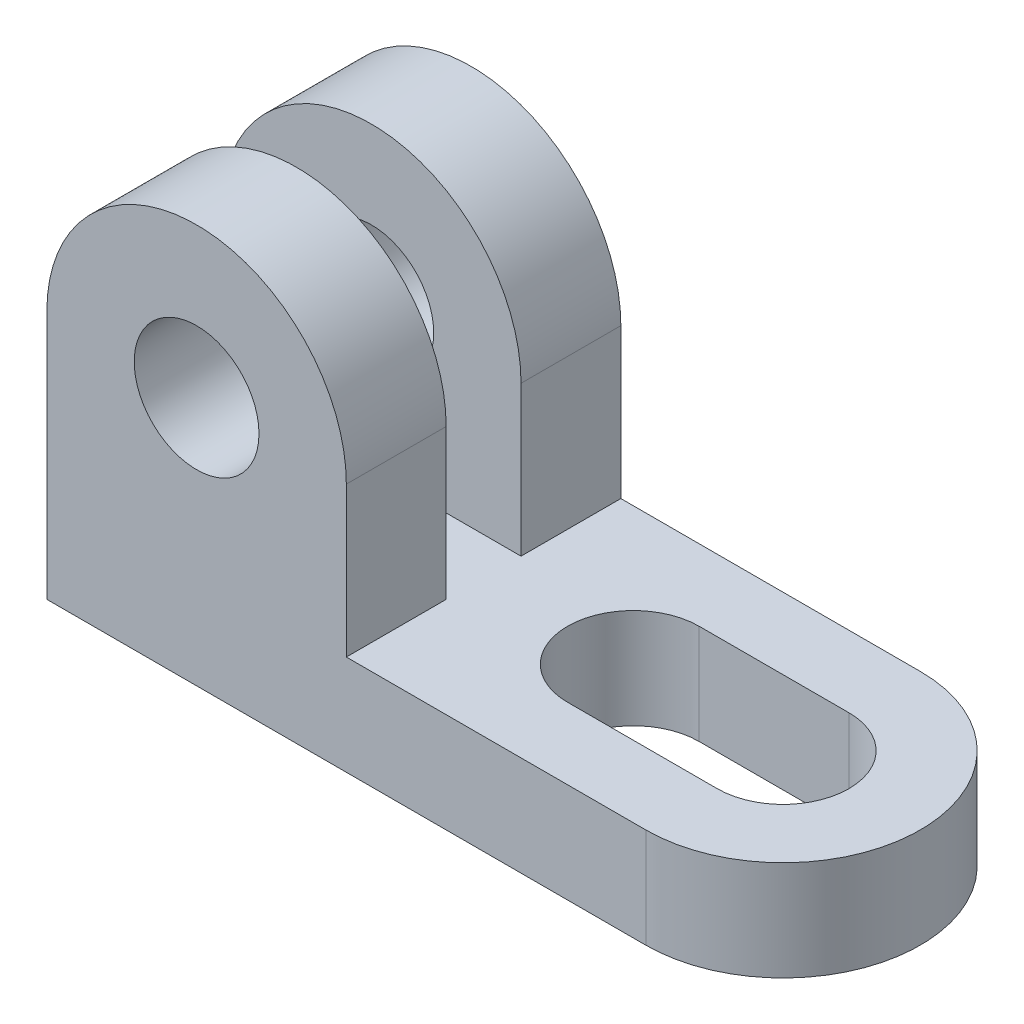
ISO-10303-21;
HEADER;
FILE_DESCRIPTION(('STEP AP214'),'2;1');
FILE_NAME('part.step','',(''),(''),'','','');
FILE_SCHEMA(('AUTOMOTIVE_DESIGN { 1 0 10303 214 1 1 1 1 }'));
ENDSEC;
DATA;
#1=APPLICATION_CONTEXT('core data for automotive mechanical design processes');
#2=APPLICATION_PROTOCOL_DEFINITION('international standard','automotive_design',2000,#1);
#3=PRODUCT_CONTEXT('',#1,'mechanical');
#4=PRODUCT('Part','Part','',(#3));
#5=PRODUCT_RELATED_PRODUCT_CATEGORY('part','',(#4));
#6=PRODUCT_DEFINITION_FORMATION('','',#4);
#7=PRODUCT_DEFINITION_CONTEXT('part definition',#1,'design');
#8=PRODUCT_DEFINITION('design','',#6,#7);
#9=PRODUCT_DEFINITION_SHAPE('','',#8);
#10=(LENGTH_UNIT() NAMED_UNIT(*) SI_UNIT(.MILLI.,.METRE.));
#11=(NAMED_UNIT(*) PLANE_ANGLE_UNIT() SI_UNIT($,.RADIAN.));
#12=(NAMED_UNIT(*) SI_UNIT($,.STERADIAN.) SOLID_ANGLE_UNIT());
#13=UNCERTAINTY_MEASURE_WITH_UNIT(LENGTH_MEASURE(1.E-05),#10,'distance_accuracy_value','');
#14=(GEOMETRIC_REPRESENTATION_CONTEXT(3) GLOBAL_UNCERTAINTY_ASSIGNED_CONTEXT((#13)) GLOBAL_UNIT_ASSIGNED_CONTEXT((#10,
#11,#12)) REPRESENTATION_CONTEXT('',''));
#15=CARTESIAN_POINT('',(0.,0.,0.));
#16=DIRECTION('',(0.,0.,1.));
#17=DIRECTION('',(1.,0.,0.));
#18=AXIS2_PLACEMENT_3D('',#15,#16,#17);
#19=CARTESIAN_POINT('',(0.,16.,0.));
#20=DIRECTION('',(0.,1.,0.));
#21=DIRECTION('',(0.,0.,1.));
#22=AXIS2_PLACEMENT_3D('',#19,#20,#21);
#23=PLANE('',#22);
#24=DIRECTION('',(-1.,0.,0.));
#25=VECTOR('',#24,1.);
#26=CARTESIAN_POINT('',(0.,16.,-10.548244424278));
#27=LINE('',#26,#25);
#28=CARTESIAN_POINT('',(37.,16.,-10.548244424278));
#29=VERTEX_POINT('',#28);
#30=CARTESIAN_POINT('',(13.,16.,-10.548244424278));
#31=VERTEX_POINT('',#30);
#32=EDGE_CURVE('E262',#29,#31,#27,.T.);
#33=ORIENTED_EDGE('',*,*,#32,.F.);
#34=CARTESIAN_POINT('',(37.,16.,0.));
#35=DIRECTION('',(0.,1.,0.));
#36=DIRECTION('',(0.,0.,1.));
#37=AXIS2_PLACEMENT_3D('',#34,#35,#36);
#38=CIRCLE('',#37,10.548244424278);
#39=CARTESIAN_POINT('',(37.,16.,10.548244424278));
#40=VERTEX_POINT('',#39);
#41=EDGE_CURVE('E266',#40,#29,#38,.T.);
#42=ORIENTED_EDGE('',*,*,#41,.F.);
#43=DIRECTION('',(-1.,0.,0.));
#44=VECTOR('',#43,1.);
#45=CARTESIAN_POINT('',(0.,16.,10.548244424278));
#46=LINE('',#45,#44);
#47=CARTESIAN_POINT('',(13.,16.,10.548244424278));
#48=VERTEX_POINT('',#47);
#49=EDGE_CURVE('E271',#40,#48,#46,.T.);
#50=ORIENTED_EDGE('',*,*,#49,.T.);
#51=CARTESIAN_POINT('',(13.,16.,0.));
#52=DIRECTION('',(0.,1.,0.));
#53=DIRECTION('',(0.,0.,1.));
#54=AXIS2_PLACEMENT_3D('',#51,#52,#53);
#55=CIRCLE('',#54,10.548244424278);
#56=EDGE_CURVE('E274',#31,#48,#55,.T.);
#57=ORIENTED_EDGE('',*,*,#56,.F.);
#58=EDGE_LOOP('',(#33,#42,#50,#57));
#59=FACE_BOUND('',#58,.T.);
#60=DIRECTION('',(1.,0.,0.));
#61=VECTOR('',#60,1.);
#62=CARTESIAN_POINT('',(0.,16.,-22.));
#63=LINE('',#62,#61);
#64=CARTESIAN_POINT('',(-11.,16.,-22.));
#65=VERTEX_POINT('',#64);
#66=CARTESIAN_POINT('',(37.,16.,-22.));
#67=VERTEX_POINT('',#66);
#68=EDGE_CURVE('E282',#65,#67,#63,.T.);
#69=ORIENTED_EDGE('',*,*,#68,.F.);
#70=DIRECTION('',(0.,0.,-1.));
#71=VECTOR('',#70,1.);
#72=CARTESIAN_POINT('',(-11.,16.,-6.));
#73=LINE('',#72,#71);
#74=CARTESIAN_POINT('',(-11.,16.,-6.));
#75=VERTEX_POINT('',#74);
#76=EDGE_CURVE('E213',#75,#65,#73,.T.);
#77=ORIENTED_EDGE('',*,*,#76,.F.);
#78=DIRECTION('',(-1.,0.,0.));
#79=VECTOR('',#78,1.);
#80=CARTESIAN_POINT('',(0.,16.,-6.));
#81=LINE('',#80,#79);
#82=CARTESIAN_POINT('',(-59.,16.,-6.));
#83=VERTEX_POINT('',#82);
#84=EDGE_CURVE('E205',#75,#83,#81,.T.);
#85=ORIENTED_EDGE('',*,*,#84,.T.);
#86=DIRECTION('',(0.,0.,1.));
#87=VECTOR('',#86,1.);
#88=CARTESIAN_POINT('',(-59.,16.,0.));
#89=LINE('',#88,#87);
#90=CARTESIAN_POINT('',(-59.,16.,6.));
#91=VERTEX_POINT('',#90);
#92=EDGE_CURVE('E285',#83,#91,#89,.T.);
#93=ORIENTED_EDGE('',*,*,#92,.T.);
#94=DIRECTION('',(-1.,0.,0.));
#95=VECTOR('',#94,1.);
#96=CARTESIAN_POINT('',(0.,16.,6.));
#97=LINE('',#96,#95);
#98=CARTESIAN_POINT('',(-11.,16.,6.));
#99=VERTEX_POINT('',#98);
#100=EDGE_CURVE('E230',#99,#91,#97,.T.);
#101=ORIENTED_EDGE('',*,*,#100,.F.);
#102=DIRECTION('',(0.,0.,1.));
#103=VECTOR('',#102,1.);
#104=CARTESIAN_POINT('',(-11.,16.,6.));
#105=LINE('',#104,#103);
#106=CARTESIAN_POINT('',(-11.,16.,22.));
#107=VERTEX_POINT('',#106);
#108=EDGE_CURVE('E242',#99,#107,#105,.T.);
#109=ORIENTED_EDGE('',*,*,#108,.T.);
#110=DIRECTION('',(1.,0.,0.));
#111=VECTOR('',#110,1.);
#112=CARTESIAN_POINT('',(0.,16.,22.));
#113=LINE('',#112,#111);
#114=CARTESIAN_POINT('',(37.,16.,22.));
#115=VERTEX_POINT('',#114);
#116=EDGE_CURVE('E288',#107,#115,#113,.T.);
#117=ORIENTED_EDGE('',*,*,#116,.T.);
#118=CARTESIAN_POINT('',(37.,16.,0.));
#119=DIRECTION('',(0.,1.,0.));
#120=DIRECTION('',(0.,0.,1.));
#121=AXIS2_PLACEMENT_3D('',#118,#119,#120);
#122=CIRCLE('',#121,22.);
#123=EDGE_CURVE('E278',#115,#67,#122,.T.);
#124=ORIENTED_EDGE('',*,*,#123,.T.);
#125=EDGE_LOOP('',(#69,#77,#85,#93,#101,#109,#117,#124));
#126=FACE_BOUND('',#125,.T.);
#127=ADVANCED_FACE('F85',(#59,#126),#23,.T.);
#128=CARTESIAN_POINT('',(37.,16.,0.));
#129=DIRECTION('',(0.,-1.,0.));
#130=DIRECTION('',(0.,0.,-1.));
#131=AXIS2_PLACEMENT_3D('',#128,#129,#130);
#132=CYLINDRICAL_SURFACE('',#131,22.);
#133=CARTESIAN_POINT('',(37.,0.,0.));
#134=DIRECTION('',(0.,1.,0.));
#135=DIRECTION('',(0.,0.,1.));
#136=AXIS2_PLACEMENT_3D('',#133,#134,#135);
#137=CIRCLE('',#136,22.);
#138=CARTESIAN_POINT('',(37.,0.,22.));
#139=VERTEX_POINT('',#138);
#140=CARTESIAN_POINT('',(37.,0.,-22.));
#141=VERTEX_POINT('',#140);
#142=EDGE_CURVE('E307',#139,#141,#137,.T.);
#143=ORIENTED_EDGE('',*,*,#142,.T.);
#144=DIRECTION('',(0.,-1.,0.));
#145=VECTOR('',#144,1.);
#146=CARTESIAN_POINT('',(37.,16.,-22.));
#147=LINE('',#146,#145);
#148=EDGE_CURVE('E12',#67,#141,#147,.T.);
#149=ORIENTED_EDGE('',*,*,#148,.F.);
#150=ORIENTED_EDGE('',*,*,#123,.F.);
#151=DIRECTION('',(0.,-1.,0.));
#152=VECTOR('',#151,1.);
#153=CARTESIAN_POINT('',(37.,16.,22.));
#154=LINE('',#153,#152);
#155=EDGE_CURVE('E321',#115,#139,#154,.T.);
#156=ORIENTED_EDGE('',*,*,#155,.T.);
#157=EDGE_LOOP('',(#143,#149,#150,#156));
#158=FACE_BOUND('',#157,.T.);
#159=ADVANCED_FACE('F359',(#158),#132,.T.);
#160=CARTESIAN_POINT('',(0.,16.,-22.));
#161=DIRECTION('',(0.,0.,-1.));
#162=DIRECTION('',(-1.,0.,0.));
#163=AXIS2_PLACEMENT_3D('',#160,#161,#162);
#164=PLANE('',#163);
#165=CARTESIAN_POINT('',(-35.,40.,-22.));
#166=DIRECTION('',(0.,0.,1.));
#167=DIRECTION('',(1.,0.,0.));
#168=AXIS2_PLACEMENT_3D('',#165,#166,#167);
#169=CIRCLE('',#168,10.);
#170=CARTESIAN_POINT('',(-25.,40.,-22.));
#171=VERTEX_POINT('',#170);
#172=EDGE_CURVE('E379',#171,#171,#169,.T.);
#173=ORIENTED_EDGE('',*,*,#172,.T.);
#174=EDGE_LOOP('',(#173));
#175=FACE_BOUND('',#174,.T.);
#176=DIRECTION('',(1.,0.,0.));
#177=VECTOR('',#176,1.);
#178=CARTESIAN_POINT('',(0.,0.,-22.));
#179=LINE('',#178,#177);
#180=CARTESIAN_POINT('',(-59.,0.,-22.));
#181=VERTEX_POINT('',#180);
#182=EDGE_CURVE('E311',#181,#141,#179,.T.);
#183=ORIENTED_EDGE('',*,*,#182,.F.);
#184=DIRECTION('',(0.,-1.,0.));
#185=VECTOR('',#184,1.);
#186=CARTESIAN_POINT('',(-59.,16.,-22.));
#187=LINE('',#186,#185);
#188=CARTESIAN_POINT('',(-59.,40.,-22.));
#189=VERTEX_POINT('',#188);
#190=EDGE_CURVE('E95',#189,#181,#187,.T.);
#191=ORIENTED_EDGE('',*,*,#190,.F.);
#192=CARTESIAN_POINT('',(-35.,40.,-22.));
#193=DIRECTION('',(0.,0.,1.));
#194=DIRECTION('',(1.,0.,0.));
#195=AXIS2_PLACEMENT_3D('',#192,#193,#194);
#196=CIRCLE('',#195,24.);
#197=CARTESIAN_POINT('',(-11.,40.,-22.));
#198=VERTEX_POINT('',#197);
#199=EDGE_CURVE('E199',#198,#189,#196,.T.);
#200=ORIENTED_EDGE('',*,*,#199,.F.);
#201=DIRECTION('',(0.,1.,0.));
#202=VECTOR('',#201,1.);
#203=CARTESIAN_POINT('',(-11.,0.,-22.));
#204=LINE('',#203,#202);
#205=EDGE_CURVE('E103',#65,#198,#204,.T.);
#206=ORIENTED_EDGE('',*,*,#205,.F.);
#207=ORIENTED_EDGE('',*,*,#68,.T.);
#208=ORIENTED_EDGE('',*,*,#148,.T.);
#209=EDGE_LOOP('',(#183,#191,#200,#206,#207,#208));
#210=FACE_BOUND('',#209,.T.);
#211=ADVANCED_FACE('F365',(#175,#210),#164,.T.);
#212=CARTESIAN_POINT('',(-59.,16.,0.));
#213=DIRECTION('',(1.,0.,0.));
#214=DIRECTION('',(0.,0.,-1.));
#215=AXIS2_PLACEMENT_3D('',#212,#213,#214);
#216=PLANE('',#215);
#217=DIRECTION('',(0.,1.,0.));
#218=VECTOR('',#217,1.);
#219=CARTESIAN_POINT('',(-59.,0.,6.));
#220=LINE('',#219,#218);
#221=CARTESIAN_POINT('',(-59.,40.,6.));
#222=VERTEX_POINT('',#221);
#223=EDGE_CURVE('E238',#91,#222,#220,.T.);
#224=ORIENTED_EDGE('',*,*,#223,.F.);
#225=ORIENTED_EDGE('',*,*,#92,.F.);
#226=DIRECTION('',(0.,1.,0.));
#227=VECTOR('',#226,1.);
#228=CARTESIAN_POINT('',(-59.,0.,-6.));
#229=LINE('',#228,#227);
#230=CARTESIAN_POINT('',(-59.,40.,-6.));
#231=VERTEX_POINT('',#230);
#232=EDGE_CURVE('E209',#83,#231,#229,.T.);
#233=ORIENTED_EDGE('',*,*,#232,.T.);
#234=DIRECTION('',(0.,0.,-1.));
#235=VECTOR('',#234,1.);
#236=CARTESIAN_POINT('',(-59.,40.,-6.));
#237=LINE('',#236,#235);
#238=EDGE_CURVE('E195',#231,#189,#237,.T.);
#239=ORIENTED_EDGE('',*,*,#238,.T.);
#240=ORIENTED_EDGE('',*,*,#190,.T.);
#241=DIRECTION('',(0.,0.,1.));
#242=VECTOR('',#241,1.);
#243=CARTESIAN_POINT('',(-59.,0.,0.));
#244=LINE('',#243,#242);
#245=CARTESIAN_POINT('',(-59.,0.,22.));
#246=VERTEX_POINT('',#245);
#247=EDGE_CURVE('E315',#181,#246,#244,.T.);
#248=ORIENTED_EDGE('',*,*,#247,.T.);
#249=DIRECTION('',(0.,-1.,0.));
#250=VECTOR('',#249,1.);
#251=CARTESIAN_POINT('',(-59.,16.,22.));
#252=LINE('',#251,#250);
#253=CARTESIAN_POINT('',(-59.,40.,22.));
#254=VERTEX_POINT('',#253);
#255=EDGE_CURVE('E325',#254,#246,#252,.T.);
#256=ORIENTED_EDGE('',*,*,#255,.F.);
#257=DIRECTION('',(0.,0.,1.));
#258=VECTOR('',#257,1.);
#259=CARTESIAN_POINT('',(-59.,40.,6.));
#260=LINE('',#259,#258);
#261=EDGE_CURVE('E246',#222,#254,#260,.T.);
#262=ORIENTED_EDGE('',*,*,#261,.F.);
#263=EDGE_LOOP('',(#224,#225,#233,#239,#240,#248,#256,#262));
#264=FACE_BOUND('',#263,.T.);
#265=ADVANCED_FACE('F373',(#264),#216,.F.);
#266=CARTESIAN_POINT('',(0.,16.,-10.548244424278));
#267=DIRECTION('',(0.,0.,1.));
#268=DIRECTION('',(1.,0.,0.));
#269=AXIS2_PLACEMENT_3D('',#266,#267,#268);
#270=PLANE('',#269);
#271=DIRECTION('',(-1.,0.,0.));
#272=VECTOR('',#271,1.);
#273=CARTESIAN_POINT('',(0.,0.,-10.548244424278));
#274=LINE('',#273,#272);
#275=CARTESIAN_POINT('',(37.,0.,-10.548244424278));
#276=VERTEX_POINT('',#275);
#277=CARTESIAN_POINT('',(13.,0.,-10.548244424278));
#278=VERTEX_POINT('',#277);
#279=EDGE_CURVE('E250',#276,#278,#274,.T.);
#280=ORIENTED_EDGE('',*,*,#279,.F.);
#281=DIRECTION('',(0.,-1.,0.));
#282=VECTOR('',#281,1.);
#283=CARTESIAN_POINT('',(37.,16.,-10.548244424278));
#284=LINE('',#283,#282);
#285=EDGE_CURVE('E89',#29,#276,#284,.T.);
#286=ORIENTED_EDGE('',*,*,#285,.F.);
#287=ORIENTED_EDGE('',*,*,#32,.T.);
#288=DIRECTION('',(0.,-1.,0.));
#289=VECTOR('',#288,1.);
#290=CARTESIAN_POINT('',(13.,16.,-10.548244424278));
#291=LINE('',#290,#289);
#292=EDGE_CURVE('E291',#31,#278,#291,.T.);
#293=ORIENTED_EDGE('',*,*,#292,.T.);
#294=EDGE_LOOP('',(#280,#286,#287,#293));
#295=FACE_BOUND('',#294,.T.);
#296=ADVANCED_FACE('F87',(#295),#270,.T.);
#297=CARTESIAN_POINT('',(37.,16.,0.));
#298=DIRECTION('',(0.,-1.,0.));
#299=DIRECTION('',(0.,0.,-1.));
#300=AXIS2_PLACEMENT_3D('',#297,#298,#299);
#301=CYLINDRICAL_SURFACE('',#300,10.548244424278);
#302=CARTESIAN_POINT('',(37.,0.,0.));
#303=DIRECTION('',(0.,1.,0.));
#304=DIRECTION('',(0.,0.,1.));
#305=AXIS2_PLACEMENT_3D('',#302,#303,#304);
#306=CIRCLE('',#305,10.548244424278);
#307=CARTESIAN_POINT('',(37.,0.,10.548244424278));
#308=VERTEX_POINT('',#307);
#309=EDGE_CURVE('E295',#308,#276,#306,.T.);
#310=ORIENTED_EDGE('',*,*,#309,.F.);
#311=DIRECTION('',(0.,-1.,0.));
#312=VECTOR('',#311,1.);
#313=CARTESIAN_POINT('',(37.,16.,10.548244424278));
#314=LINE('',#313,#312);
#315=EDGE_CURVE('E334',#40,#308,#314,.T.);
#316=ORIENTED_EDGE('',*,*,#315,.F.);
#317=ORIENTED_EDGE('',*,*,#41,.T.);
#318=ORIENTED_EDGE('',*,*,#285,.T.);
#319=EDGE_LOOP('',(#310,#316,#317,#318));
#320=FACE_BOUND('',#319,.T.);
#321=ADVANCED_FACE('F343',(#320),#301,.F.);
#322=CARTESIAN_POINT('',(0.,16.,10.548244424278));
#323=DIRECTION('',(0.,0.,1.));
#324=DIRECTION('',(1.,0.,0.));
#325=AXIS2_PLACEMENT_3D('',#322,#323,#324);
#326=PLANE('',#325);
#327=DIRECTION('',(-1.,0.,0.));
#328=VECTOR('',#327,1.);
#329=CARTESIAN_POINT('',(0.,0.,10.548244424278));
#330=LINE('',#329,#328);
#331=CARTESIAN_POINT('',(13.,0.,10.548244424278));
#332=VERTEX_POINT('',#331);
#333=EDGE_CURVE('E299',#308,#332,#330,.T.);
#334=ORIENTED_EDGE('',*,*,#333,.T.);
#335=DIRECTION('',(0.,-1.,0.));
#336=VECTOR('',#335,1.);
#337=CARTESIAN_POINT('',(13.,16.,10.548244424278));
#338=LINE('',#337,#336);
#339=EDGE_CURVE('E332',#48,#332,#338,.T.);
#340=ORIENTED_EDGE('',*,*,#339,.F.);
#341=ORIENTED_EDGE('',*,*,#49,.F.);
#342=ORIENTED_EDGE('',*,*,#315,.T.);
#343=EDGE_LOOP('',(#334,#340,#341,#342));
#344=FACE_BOUND('',#343,.T.);
#345=ADVANCED_FACE('F352',(#344),#326,.F.);
#346=CARTESIAN_POINT('',(13.,16.,0.));
#347=DIRECTION('',(0.,-1.,0.));
#348=DIRECTION('',(0.,0.,-1.));
#349=AXIS2_PLACEMENT_3D('',#346,#347,#348);
#350=CYLINDRICAL_SURFACE('',#349,10.548244424278);
#351=CARTESIAN_POINT('',(13.,0.,0.));
#352=DIRECTION('',(0.,1.,0.));
#353=DIRECTION('',(0.,0.,1.));
#354=AXIS2_PLACEMENT_3D('',#351,#352,#353);
#355=CIRCLE('',#354,10.548244424278);
#356=EDGE_CURVE('E303',#278,#332,#355,.T.);
#357=ORIENTED_EDGE('',*,*,#356,.F.);
#358=ORIENTED_EDGE('',*,*,#292,.F.);
#359=ORIENTED_EDGE('',*,*,#56,.T.);
#360=ORIENTED_EDGE('',*,*,#339,.T.);
#361=EDGE_LOOP('',(#357,#358,#359,#360));
#362=FACE_BOUND('',#361,.T.);
#363=ADVANCED_FACE('F355',(#362),#350,.F.);
#364=CARTESIAN_POINT('',(0.,16.,22.));
#365=DIRECTION('',(0.,0.,-1.));
#366=DIRECTION('',(-1.,0.,0.));
#367=AXIS2_PLACEMENT_3D('',#364,#365,#366);
#368=PLANE('',#367);
#369=CARTESIAN_POINT('',(-35.,40.,22.));
#370=DIRECTION('',(0.,0.,1.));
#371=DIRECTION('',(1.,0.,0.));
#372=AXIS2_PLACEMENT_3D('',#369,#370,#371);
#373=CIRCLE('',#372,10.);
#374=CARTESIAN_POINT('',(-25.,40.,22.));
#375=VERTEX_POINT('',#374);
#376=EDGE_CURVE('E217',#375,#375,#373,.T.);
#377=ORIENTED_EDGE('',*,*,#376,.F.);
#378=EDGE_LOOP('',(#377));
#379=FACE_BOUND('',#378,.T.);
#380=ORIENTED_EDGE('',*,*,#255,.T.);
#381=DIRECTION('',(1.,0.,0.));
#382=VECTOR('',#381,1.);
#383=CARTESIAN_POINT('',(0.,0.,22.));
#384=LINE('',#383,#382);
#385=EDGE_CURVE('E267',#246,#139,#384,.T.);
#386=ORIENTED_EDGE('',*,*,#385,.T.);
#387=ORIENTED_EDGE('',*,*,#155,.F.);
#388=ORIENTED_EDGE('',*,*,#116,.F.);
#389=DIRECTION('',(0.,1.,0.));
#390=VECTOR('',#389,1.);
#391=CARTESIAN_POINT('',(-11.,0.,22.));
#392=LINE('',#391,#390);
#393=CARTESIAN_POINT('',(-11.,40.,22.));
#394=VERTEX_POINT('',#393);
#395=EDGE_CURVE('E111',#107,#394,#392,.T.);
#396=ORIENTED_EDGE('',*,*,#395,.T.);
#397=CARTESIAN_POINT('',(-35.,40.,22.));
#398=DIRECTION('',(0.,0.,1.));
#399=DIRECTION('',(1.,0.,0.));
#400=AXIS2_PLACEMENT_3D('',#397,#398,#399);
#401=CIRCLE('',#400,24.);
#402=EDGE_CURVE('E226',#394,#254,#401,.T.);
#403=ORIENTED_EDGE('',*,*,#402,.T.);
#404=EDGE_LOOP('',(#380,#386,#387,#388,#396,#403));
#405=FACE_BOUND('',#404,.T.);
#406=ADVANCED_FACE('F399',(#379,#405),#368,.F.);
#407=CARTESIAN_POINT('',(0.,0.,0.));
#408=DIRECTION('',(0.,1.,0.));
#409=DIRECTION('',(0.,0.,1.));
#410=AXIS2_PLACEMENT_3D('',#407,#408,#409);
#411=PLANE('',#410);
#412=ORIENTED_EDGE('',*,*,#279,.T.);
#413=ORIENTED_EDGE('',*,*,#356,.T.);
#414=ORIENTED_EDGE('',*,*,#333,.F.);
#415=ORIENTED_EDGE('',*,*,#309,.T.);
#416=EDGE_LOOP('',(#412,#413,#414,#415));
#417=FACE_BOUND('',#416,.T.);
#418=ORIENTED_EDGE('',*,*,#142,.F.);
#419=ORIENTED_EDGE('',*,*,#385,.F.);
#420=ORIENTED_EDGE('',*,*,#247,.F.);
#421=ORIENTED_EDGE('',*,*,#182,.T.);
#422=EDGE_LOOP('',(#418,#419,#420,#421));
#423=FACE_BOUND('',#422,.T.);
#424=ADVANCED_FACE('F349',(#417,#423),#411,.F.);
#425=CARTESIAN_POINT('',(-11.,0.,6.));
#426=DIRECTION('',(1.,0.,0.));
#427=DIRECTION('',(0.,1.,0.));
#428=AXIS2_PLACEMENT_3D('',#425,#426,#427);
#429=PLANE('',#428);
#430=ORIENTED_EDGE('',*,*,#395,.F.);
#431=ORIENTED_EDGE('',*,*,#108,.F.);
#432=DIRECTION('',(0.,1.,0.));
#433=VECTOR('',#432,1.);
#434=CARTESIAN_POINT('',(-11.,0.,6.));
#435=LINE('',#434,#433);
#436=CARTESIAN_POINT('',(-11.,40.,6.));
#437=VERTEX_POINT('',#436);
#438=EDGE_CURVE('E234',#99,#437,#435,.T.);
#439=ORIENTED_EDGE('',*,*,#438,.T.);
#440=DIRECTION('',(0.,0.,1.));
#441=VECTOR('',#440,1.);
#442=CARTESIAN_POINT('',(-11.,40.,6.));
#443=LINE('',#442,#441);
#444=EDGE_CURVE('E251',#437,#394,#443,.T.);
#445=ORIENTED_EDGE('',*,*,#444,.T.);
#446=EDGE_LOOP('',(#430,#431,#439,#445));
#447=FACE_BOUND('',#446,.T.);
#448=ADVANCED_FACE('F396',(#447),#429,.T.);
#449=CARTESIAN_POINT('',(0.,0.,6.));
#450=DIRECTION('',(0.,0.,1.));
#451=DIRECTION('',(1.,0.,0.));
#452=AXIS2_PLACEMENT_3D('',#449,#450,#451);
#453=PLANE('',#452);
#454=CARTESIAN_POINT('',(-35.,40.,6.));
#455=DIRECTION('',(0.,0.,1.));
#456=DIRECTION('',(1.,0.,0.));
#457=AXIS2_PLACEMENT_3D('',#454,#455,#456);
#458=CIRCLE('',#457,10.);
#459=CARTESIAN_POINT('',(-25.,40.,6.));
#460=VERTEX_POINT('',#459);
#461=EDGE_CURVE('E222',#460,#460,#458,.T.);
#462=ORIENTED_EDGE('',*,*,#461,.T.);
#463=EDGE_LOOP('',(#462));
#464=FACE_BOUND('',#463,.T.);
#465=CARTESIAN_POINT('',(-35.,40.,6.));
#466=DIRECTION('',(0.,0.,1.));
#467=DIRECTION('',(1.,0.,0.));
#468=AXIS2_PLACEMENT_3D('',#465,#466,#467);
#469=CIRCLE('',#468,24.);
#470=EDGE_CURVE('E245',#437,#222,#469,.T.);
#471=ORIENTED_EDGE('',*,*,#470,.F.);
#472=ORIENTED_EDGE('',*,*,#438,.F.);
#473=ORIENTED_EDGE('',*,*,#100,.T.);
#474=ORIENTED_EDGE('',*,*,#223,.T.);
#475=EDGE_LOOP('',(#471,#472,#473,#474));
#476=FACE_BOUND('',#475,.T.);
#477=ADVANCED_FACE('F392',(#464,#476),#453,.F.);
#478=CARTESIAN_POINT('',(-35.,40.,6.));
#479=DIRECTION('',(0.,0.,1.));
#480=DIRECTION('',(1.,0.,0.));
#481=AXIS2_PLACEMENT_3D('',#478,#479,#480);
#482=CYLINDRICAL_SURFACE('',#481,24.);
#483=ORIENTED_EDGE('',*,*,#261,.T.);
#484=ORIENTED_EDGE('',*,*,#402,.F.);
#485=ORIENTED_EDGE('',*,*,#444,.F.);
#486=ORIENTED_EDGE('',*,*,#470,.T.);
#487=EDGE_LOOP('',(#483,#484,#485,#486));
#488=FACE_BOUND('',#487,.T.);
#489=ADVANCED_FACE('F395',(#488),#482,.T.);
#490=CARTESIAN_POINT('',(-35.,40.,6.));
#491=DIRECTION('',(0.,0.,1.));
#492=DIRECTION('',(1.,0.,0.));
#493=AXIS2_PLACEMENT_3D('',#490,#491,#492);
#494=CYLINDRICAL_SURFACE('',#493,10.);
#495=ORIENTED_EDGE('',*,*,#461,.F.);
#496=EDGE_LOOP('',(#495));
#497=FACE_BOUND('',#496,.T.);
#498=ORIENTED_EDGE('',*,*,#376,.T.);
#499=EDGE_LOOP('',(#498));
#500=FACE_BOUND('',#499,.T.);
#501=ADVANCED_FACE('F450',(#497,#500),#494,.F.);
#502=CARTESIAN_POINT('',(-11.,0.,-6.));
#503=DIRECTION('',(-1.,0.,0.));
#504=DIRECTION('',(0.,-1.,0.));
#505=AXIS2_PLACEMENT_3D('',#502,#503,#504);
#506=PLANE('',#505);
#507=ORIENTED_EDGE('',*,*,#205,.T.);
#508=DIRECTION('',(0.,0.,-1.));
#509=VECTOR('',#508,1.);
#510=CARTESIAN_POINT('',(-11.,40.,-6.));
#511=LINE('',#510,#509);
#512=CARTESIAN_POINT('',(-11.,40.,-6.));
#513=VERTEX_POINT('',#512);
#514=EDGE_CURVE('E193',#513,#198,#511,.T.);
#515=ORIENTED_EDGE('',*,*,#514,.F.);
#516=DIRECTION('',(0.,1.,0.));
#517=VECTOR('',#516,1.);
#518=CARTESIAN_POINT('',(-11.,0.,-6.));
#519=LINE('',#518,#517);
#520=EDGE_CURVE('E202',#75,#513,#519,.T.);
#521=ORIENTED_EDGE('',*,*,#520,.F.);
#522=ORIENTED_EDGE('',*,*,#76,.T.);
#523=EDGE_LOOP('',(#507,#515,#521,#522));
#524=FACE_BOUND('',#523,.T.);
#525=ADVANCED_FACE('F211',(#524),#506,.F.);
#526=CARTESIAN_POINT('',(0.,0.,-6.));
#527=DIRECTION('',(0.,0.,-1.));
#528=DIRECTION('',(1.,0.,0.));
#529=AXIS2_PLACEMENT_3D('',#526,#527,#528);
#530=PLANE('',#529);
#531=CARTESIAN_POINT('',(-35.,40.,-6.));
#532=DIRECTION('',(0.,0.,1.));
#533=DIRECTION('',(1.,0.,0.));
#534=AXIS2_PLACEMENT_3D('',#531,#532,#533);
#535=CIRCLE('',#534,10.);
#536=CARTESIAN_POINT('',(-25.,40.,-6.));
#537=VERTEX_POINT('',#536);
#538=EDGE_CURVE('E375',#537,#537,#535,.T.);
#539=ORIENTED_EDGE('',*,*,#538,.F.);
#540=EDGE_LOOP('',(#539));
#541=FACE_BOUND('',#540,.T.);
#542=ORIENTED_EDGE('',*,*,#520,.T.);
#543=CARTESIAN_POINT('',(-35.,40.,-6.));
#544=DIRECTION('',(0.,0.,1.));
#545=DIRECTION('',(1.,0.,0.));
#546=AXIS2_PLACEMENT_3D('',#543,#544,#545);
#547=CIRCLE('',#546,24.);
#548=EDGE_CURVE('E188',#513,#231,#547,.T.);
#549=ORIENTED_EDGE('',*,*,#548,.T.);
#550=ORIENTED_EDGE('',*,*,#232,.F.);
#551=ORIENTED_EDGE('',*,*,#84,.F.);
#552=EDGE_LOOP('',(#542,#549,#550,#551));
#553=FACE_BOUND('',#552,.T.);
#554=ADVANCED_FACE('F203',(#541,#553),#530,.F.);
#555=CARTESIAN_POINT('',(-35.,40.,-6.));
#556=DIRECTION('',(0.,0.,-1.));
#557=DIRECTION('',(-1.,0.,0.));
#558=AXIS2_PLACEMENT_3D('',#555,#556,#557);
#559=CYLINDRICAL_SURFACE('',#558,24.);
#560=ORIENTED_EDGE('',*,*,#514,.T.);
#561=ORIENTED_EDGE('',*,*,#199,.T.);
#562=ORIENTED_EDGE('',*,*,#238,.F.);
#563=ORIENTED_EDGE('',*,*,#548,.F.);
#564=EDGE_LOOP('',(#560,#561,#562,#563));
#565=FACE_BOUND('',#564,.T.);
#566=ADVANCED_FACE('F190',(#565),#559,.T.);
#567=CARTESIAN_POINT('',(-35.,40.,-6.));
#568=DIRECTION('',(0.,0.,-1.));
#569=DIRECTION('',(-1.,0.,0.));
#570=AXIS2_PLACEMENT_3D('',#567,#568,#569);
#571=CYLINDRICAL_SURFACE('',#570,10.);
#572=ORIENTED_EDGE('',*,*,#538,.T.);
#573=EDGE_LOOP('',(#572));
#574=FACE_BOUND('',#573,.T.);
#575=ORIENTED_EDGE('',*,*,#172,.F.);
#576=EDGE_LOOP('',(#575));
#577=FACE_BOUND('',#576,.T.);
#578=ADVANCED_FACE('F566',(#574,#577),#571,.F.);
#579=CLOSED_SHELL('',(#127,#159,#211,#265,#296,#321,#345,#363,#406,#424,#448,#477,#489,#501,
#525,#554,#566,#578));
#580=MANIFOLD_SOLID_BREP('B2',#579);
#581=ADVANCED_BREP_SHAPE_REPRESENTATION('',(#18,#580),#14);
#582=SHAPE_DEFINITION_REPRESENTATION(#9,#581);
ENDSEC;
END-ISO-10303-21;
